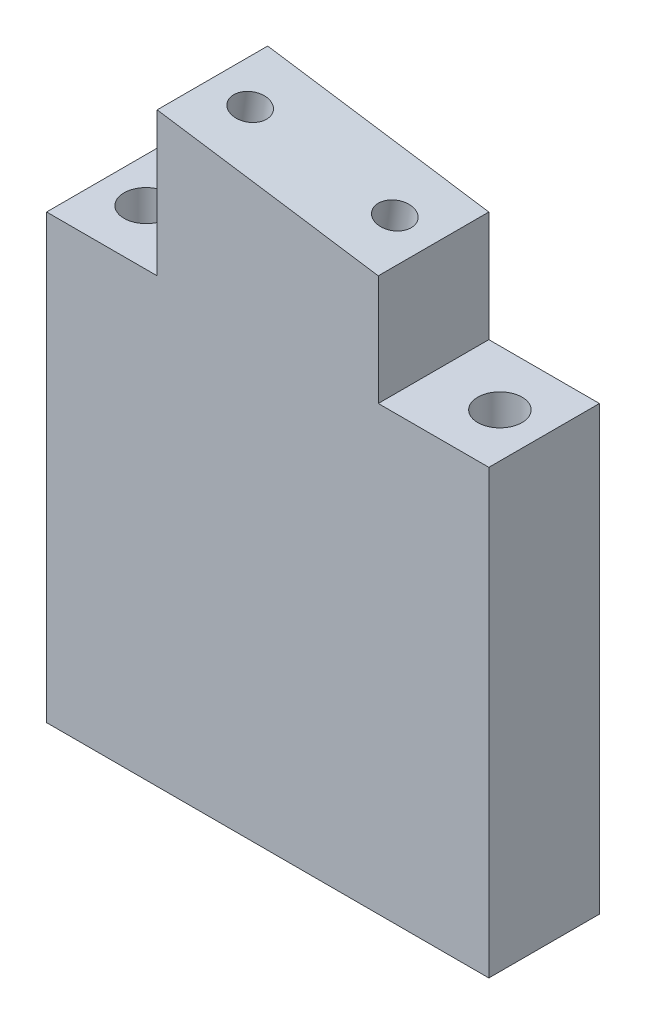
ISO-10303-21;
HEADER;
FILE_DESCRIPTION(('STEP AP214'),'2;1');
FILE_NAME('part.step','',(''),(''),'','','');
FILE_SCHEMA(('AUTOMOTIVE_DESIGN { 1 0 10303 214 1 1 1 1 }'));
ENDSEC;
DATA;
#1=APPLICATION_CONTEXT('core data for automotive mechanical design processes');
#2=APPLICATION_PROTOCOL_DEFINITION('international standard','automotive_design',2000,#1);
#3=PRODUCT_CONTEXT('',#1,'mechanical');
#4=PRODUCT('Part','Part','',(#3));
#5=PRODUCT_RELATED_PRODUCT_CATEGORY('part','',(#4));
#6=PRODUCT_DEFINITION_FORMATION('','',#4);
#7=PRODUCT_DEFINITION_CONTEXT('part definition',#1,'design');
#8=PRODUCT_DEFINITION('design','',#6,#7);
#9=PRODUCT_DEFINITION_SHAPE('','',#8);
#10=(LENGTH_UNIT() NAMED_UNIT(*) SI_UNIT(.MILLI.,.METRE.));
#11=(NAMED_UNIT(*) PLANE_ANGLE_UNIT() SI_UNIT($,.RADIAN.));
#12=(NAMED_UNIT(*) SI_UNIT($,.STERADIAN.) SOLID_ANGLE_UNIT());
#13=UNCERTAINTY_MEASURE_WITH_UNIT(LENGTH_MEASURE(1.E-05),#10,'distance_accuracy_value','');
#14=(GEOMETRIC_REPRESENTATION_CONTEXT(3) GLOBAL_UNCERTAINTY_ASSIGNED_CONTEXT((#13)) GLOBAL_UNIT_ASSIGNED_CONTEXT((#10,
#11,#12)) REPRESENTATION_CONTEXT('',''));
#15=CARTESIAN_POINT('',(0.,0.,0.));
#16=DIRECTION('',(0.,0.,1.));
#17=DIRECTION('',(1.,0.,0.));
#18=AXIS2_PLACEMENT_3D('',#15,#16,#17);
#19=CARTESIAN_POINT('',(-13.3476744186047,16.3953488372093,10.));
#20=DIRECTION('',(1.,0.,0.));
#21=DIRECTION('',(0.,1.,0.));
#22=AXIS2_PLACEMENT_3D('',#19,#20,#21);
#23=PLANE('',#22);
#24=DIRECTION('',(0.,-1.,0.));
#25=VECTOR('',#24,1.);
#26=CARTESIAN_POINT('',(-13.3476744186047,16.3953488372093,0.));
#27=LINE('',#26,#25);
#28=CARTESIAN_POINT('',(-13.3476744186047,16.3953488372093,0.));
#29=VERTEX_POINT('',#28);
#30=CARTESIAN_POINT('',(-13.3476744186047,-23.6046511627907,0.));
#31=VERTEX_POINT('',#30);
#32=EDGE_CURVE('E128',#29,#31,#27,.T.);
#33=ORIENTED_EDGE('',*,*,#32,.T.);
#34=DIRECTION('',(0.,0.,-1.));
#35=VECTOR('',#34,1.);
#36=CARTESIAN_POINT('',(-13.3476744186047,-23.6046511627907,10.));
#37=LINE('',#36,#35);
#38=CARTESIAN_POINT('',(-13.3476744186047,-23.6046511627907,10.));
#39=VERTEX_POINT('',#38);
#40=EDGE_CURVE('E11',#39,#31,#37,.T.);
#41=ORIENTED_EDGE('',*,*,#40,.F.);
#42=DIRECTION('',(0.,-1.,0.));
#43=VECTOR('',#42,1.);
#44=CARTESIAN_POINT('',(-13.3476744186047,16.3953488372093,10.));
#45=LINE('',#44,#43);
#46=CARTESIAN_POINT('',(-13.3476744186047,16.3953488372093,10.));
#47=VERTEX_POINT('',#46);
#48=EDGE_CURVE('E143',#47,#39,#45,.T.);
#49=ORIENTED_EDGE('',*,*,#48,.F.);
#50=DIRECTION('',(0.,0.,-1.));
#51=VECTOR('',#50,1.);
#52=CARTESIAN_POINT('',(-13.3476744186047,16.3953488372093,10.));
#53=LINE('',#52,#51);
#54=EDGE_CURVE('E124',#47,#29,#53,.T.);
#55=ORIENTED_EDGE('',*,*,#54,.T.);
#56=EDGE_LOOP('',(#33,#41,#49,#55));
#57=FACE_BOUND('',#56,.T.);
#58=ADVANCED_FACE('F32',(#57),#23,.F.);
#59=CARTESIAN_POINT('',(-13.3476744186047,-23.6046511627907,10.));
#60=DIRECTION('',(0.,1.,0.));
#61=DIRECTION('',(0.,0.,1.));
#62=AXIS2_PLACEMENT_3D('',#59,#60,#61);
#63=PLANE('',#62);
#64=CARTESIAN_POINT('',(-9.34767441860467,-23.6046511627907,5.));
#65=DIRECTION('',(0.,1.,0.));
#66=DIRECTION('',(0.,0.,1.));
#67=AXIS2_PLACEMENT_3D('',#64,#65,#66);
#68=CIRCLE('',#67,2.);
#69=CARTESIAN_POINT('',(-9.34767441860467,-23.6046511627907,7.));
#70=VERTEX_POINT('',#69);
#71=EDGE_CURVE('E193',#70,#70,#68,.T.);
#72=ORIENTED_EDGE('',*,*,#71,.T.);
#73=EDGE_LOOP('',(#72));
#74=FACE_BOUND('',#73,.T.);
#75=CARTESIAN_POINT('',(22.6523255813953,-23.6046511627907,5.));
#76=DIRECTION('',(0.,1.,0.));
#77=DIRECTION('',(0.,0.,1.));
#78=AXIS2_PLACEMENT_3D('',#75,#76,#77);
#79=CIRCLE('',#78,2.);
#80=CARTESIAN_POINT('',(22.6523255813953,-23.6046511627907,7.));
#81=VERTEX_POINT('',#80);
#82=EDGE_CURVE('E185',#81,#81,#79,.T.);
#83=ORIENTED_EDGE('',*,*,#82,.T.);
#84=EDGE_LOOP('',(#83));
#85=FACE_BOUND('',#84,.T.);
#86=DIRECTION('',(1.,0.,0.));
#87=VECTOR('',#86,1.);
#88=CARTESIAN_POINT('',(-13.3476744186047,-23.6046511627907,0.));
#89=LINE('',#88,#87);
#90=CARTESIAN_POINT('',(26.6523255813953,-23.6046511627907,0.));
#91=VERTEX_POINT('',#90);
#92=EDGE_CURVE('E131',#31,#91,#89,.T.);
#93=ORIENTED_EDGE('',*,*,#92,.T.);
#94=DIRECTION('',(0.,0.,-1.));
#95=VECTOR('',#94,1.);
#96=CARTESIAN_POINT('',(26.6523255813953,-23.6046511627907,10.));
#97=LINE('',#96,#95);
#98=CARTESIAN_POINT('',(26.6523255813953,-23.6046511627907,10.));
#99=VERTEX_POINT('',#98);
#100=EDGE_CURVE('E40',#99,#91,#97,.T.);
#101=ORIENTED_EDGE('',*,*,#100,.F.);
#102=DIRECTION('',(1.,0.,0.));
#103=VECTOR('',#102,1.);
#104=CARTESIAN_POINT('',(-13.3476744186047,-23.6046511627907,10.));
#105=LINE('',#104,#103);
#106=EDGE_CURVE('E90',#39,#99,#105,.T.);
#107=ORIENTED_EDGE('',*,*,#106,.F.);
#108=ORIENTED_EDGE('',*,*,#40,.T.);
#109=EDGE_LOOP('',(#93,#101,#107,#108));
#110=FACE_BOUND('',#109,.T.);
#111=ADVANCED_FACE('F214',(#74,#85,#110),#63,.F.);
#112=CARTESIAN_POINT('',(26.6523255813953,16.3953488372093,10.));
#113=DIRECTION('',(-1.,0.,0.));
#114=DIRECTION('',(0.,-1.,0.));
#115=AXIS2_PLACEMENT_3D('',#112,#113,#114);
#116=PLANE('',#115);
#117=DIRECTION('',(0.,1.,0.));
#118=VECTOR('',#117,1.);
#119=CARTESIAN_POINT('',(26.6523255813953,16.3953488372093,0.));
#120=LINE('',#119,#118);
#121=CARTESIAN_POINT('',(26.6523255813953,16.3953488372093,0.));
#122=VERTEX_POINT('',#121);
#123=EDGE_CURVE('E134',#91,#122,#120,.T.);
#124=ORIENTED_EDGE('',*,*,#123,.T.);
#125=DIRECTION('',(0.,0.,-1.));
#126=VECTOR('',#125,1.);
#127=CARTESIAN_POINT('',(26.6523255813953,16.3953488372093,10.));
#128=LINE('',#127,#126);
#129=CARTESIAN_POINT('',(26.6523255813953,16.3953488372093,10.));
#130=VERTEX_POINT('',#129);
#131=EDGE_CURVE('E150',#130,#122,#128,.T.);
#132=ORIENTED_EDGE('',*,*,#131,.F.);
#133=DIRECTION('',(0.,1.,0.));
#134=VECTOR('',#133,1.);
#135=CARTESIAN_POINT('',(26.6523255813953,16.3953488372093,10.));
#136=LINE('',#135,#134);
#137=EDGE_CURVE('E158',#99,#130,#136,.T.);
#138=ORIENTED_EDGE('',*,*,#137,.F.);
#139=ORIENTED_EDGE('',*,*,#100,.T.);
#140=EDGE_LOOP('',(#124,#132,#138,#139));
#141=FACE_BOUND('',#140,.T.);
#142=ADVANCED_FACE('F156',(#141),#116,.F.);
#143=CARTESIAN_POINT('',(16.6523255813953,16.3953488372093,10.));
#144=DIRECTION('',(0.,-1.,0.));
#145=DIRECTION('',(1.,0.,0.));
#146=AXIS2_PLACEMENT_3D('',#143,#144,#145);
#147=PLANE('',#146);
#148=CARTESIAN_POINT('',(22.6523255813953,16.3953488372093,5.));
#149=DIRECTION('',(0.,1.,0.));
#150=DIRECTION('',(0.,0.,1.));
#151=AXIS2_PLACEMENT_3D('',#148,#149,#150);
#152=CIRCLE('',#151,2.);
#153=CARTESIAN_POINT('',(22.6523255813953,16.3953488372093,7.));
#154=VERTEX_POINT('',#153);
#155=EDGE_CURVE('E190',#154,#154,#152,.T.);
#156=ORIENTED_EDGE('',*,*,#155,.F.);
#157=EDGE_LOOP('',(#156));
#158=FACE_BOUND('',#157,.T.);
#159=DIRECTION('',(-1.,0.,0.));
#160=VECTOR('',#159,1.);
#161=CARTESIAN_POINT('',(16.6523255813953,16.3953488372093,0.));
#162=LINE('',#161,#160);
#163=CARTESIAN_POINT('',(16.6523255813953,16.3953488372093,0.));
#164=VERTEX_POINT('',#163);
#165=EDGE_CURVE('E136',#122,#164,#162,.T.);
#166=ORIENTED_EDGE('',*,*,#165,.T.);
#167=DIRECTION('',(0.,0.,-1.));
#168=VECTOR('',#167,1.);
#169=CARTESIAN_POINT('',(16.6523255813953,16.3953488372093,10.));
#170=LINE('',#169,#168);
#171=CARTESIAN_POINT('',(16.6523255813953,16.3953488372093,10.));
#172=VERTEX_POINT('',#171);
#173=EDGE_CURVE('E147',#172,#164,#170,.T.);
#174=ORIENTED_EDGE('',*,*,#173,.F.);
#175=DIRECTION('',(-1.,0.,0.));
#176=VECTOR('',#175,1.);
#177=CARTESIAN_POINT('',(16.6523255813953,16.3953488372093,10.));
#178=LINE('',#177,#176);
#179=EDGE_CURVE('E170',#130,#172,#178,.T.);
#180=ORIENTED_EDGE('',*,*,#179,.F.);
#181=ORIENTED_EDGE('',*,*,#131,.T.);
#182=EDGE_LOOP('',(#166,#174,#180,#181));
#183=FACE_BOUND('',#182,.T.);
#184=ADVANCED_FACE('F166',(#158,#183),#147,.F.);
#185=CARTESIAN_POINT('',(16.6523255813953,16.3953488372093,10.));
#186=DIRECTION('',(-1.,0.,0.));
#187=DIRECTION('',(0.,0.,1.));
#188=AXIS2_PLACEMENT_3D('',#185,#186,#187);
#189=PLANE('',#188);
#190=DIRECTION('',(0.,1.,0.));
#191=VECTOR('',#190,1.);
#192=CARTESIAN_POINT('',(16.6523255813953,16.3953488372093,0.));
#193=LINE('',#192,#191);
#194=CARTESIAN_POINT('',(16.6523255813953,26.3953488372093,0.));
#195=VERTEX_POINT('',#194);
#196=EDGE_CURVE('E138',#164,#195,#193,.T.);
#197=ORIENTED_EDGE('',*,*,#196,.T.);
#198=DIRECTION('',(0.,0.,-1.));
#199=VECTOR('',#198,1.);
#200=CARTESIAN_POINT('',(16.6523255813953,26.3953488372093,10.));
#201=LINE('',#200,#199);
#202=CARTESIAN_POINT('',(16.6523255813953,26.3953488372093,10.));
#203=VERTEX_POINT('',#202);
#204=EDGE_CURVE('E119',#203,#195,#201,.T.);
#205=ORIENTED_EDGE('',*,*,#204,.F.);
#206=DIRECTION('',(0.,1.,0.));
#207=VECTOR('',#206,1.);
#208=CARTESIAN_POINT('',(16.6523255813953,16.3953488372093,10.));
#209=LINE('',#208,#207);
#210=EDGE_CURVE('E109',#172,#203,#209,.T.);
#211=ORIENTED_EDGE('',*,*,#210,.F.);
#212=ORIENTED_EDGE('',*,*,#173,.T.);
#213=EDGE_LOOP('',(#197,#205,#211,#212));
#214=FACE_BOUND('',#213,.T.);
#215=ADVANCED_FACE('F169',(#214),#189,.F.);
#216=CARTESIAN_POINT('',(-3.34767441860466,29.3953488372093,10.));
#217=DIRECTION('',(-0.148340452930245,-0.988936352868298,0.));
#218=DIRECTION('',(0.988936352868298,-0.148340452930245,0.));
#219=AXIS2_PLACEMENT_3D('',#216,#217,#218);
#220=PLANE('',#219);
#221=CARTESIAN_POINT('',(13.1910483463563,26.9145404224652,5.04720053231722));
#222=DIRECTION('',(0.148340452930245,0.988936352868298,0.));
#223=DIRECTION('',(-0.988936352868298,0.148340452930245,0.));
#224=AXIS2_PLACEMENT_3D('',#221,#222,#223);
#225=CIRCLE('',#224,1.5);
#226=CARTESIAN_POINT('',(11.7076438170538,27.1370511018605,5.04720053231722));
#227=VERTEX_POINT('',#226);
#228=EDGE_CURVE('E182',#227,#227,#225,.T.);
#229=ORIENTED_EDGE('',*,*,#228,.F.);
#230=EDGE_LOOP('',(#229));
#231=FACE_BOUND('',#230,.T.);
#232=CARTESIAN_POINT('',(0.113602816434375,28.8761572519534,5.04720053231722));
#233=DIRECTION('',(0.148340452930245,0.988936352868298,0.));
#234=DIRECTION('',(-0.988936352868298,0.148340452930245,0.));
#235=AXIS2_PLACEMENT_3D('',#232,#233,#234);
#236=CIRCLE('',#235,1.5);
#237=CARTESIAN_POINT('',(-1.36980171286807,29.0986679313488,5.04720053231722));
#238=VERTEX_POINT('',#237);
#239=EDGE_CURVE('E176',#238,#238,#236,.T.);
#240=ORIENTED_EDGE('',*,*,#239,.F.);
#241=EDGE_LOOP('',(#240));
#242=FACE_BOUND('',#241,.T.);
#243=DIRECTION('',(-0.988936352868298,0.148340452930245,0.));
#244=VECTOR('',#243,1.);
#245=CARTESIAN_POINT('',(-3.34767441860466,29.3953488372093,0.));
#246=LINE('',#245,#244);
#247=CARTESIAN_POINT('',(-3.34767441860466,29.3953488372093,0.));
#248=VERTEX_POINT('',#247);
#249=EDGE_CURVE('E118',#195,#248,#246,.T.);
#250=ORIENTED_EDGE('',*,*,#249,.T.);
#251=DIRECTION('',(0.,0.,-1.));
#252=VECTOR('',#251,1.);
#253=CARTESIAN_POINT('',(-3.34767441860466,29.3953488372093,10.));
#254=LINE('',#253,#252);
#255=CARTESIAN_POINT('',(-3.34767441860466,29.3953488372093,10.));
#256=VERTEX_POINT('',#255);
#257=EDGE_CURVE('E115',#256,#248,#254,.T.);
#258=ORIENTED_EDGE('',*,*,#257,.F.);
#259=DIRECTION('',(-0.988936352868298,0.148340452930245,0.));
#260=VECTOR('',#259,1.);
#261=CARTESIAN_POINT('',(-3.34767441860466,29.3953488372093,10.));
#262=LINE('',#261,#260);
#263=EDGE_CURVE('E103',#203,#256,#262,.T.);
#264=ORIENTED_EDGE('',*,*,#263,.F.);
#265=ORIENTED_EDGE('',*,*,#204,.T.);
#266=EDGE_LOOP('',(#250,#258,#264,#265));
#267=FACE_BOUND('',#266,.T.);
#268=ADVANCED_FACE('F116',(#231,#242,#267),#220,.F.);
#269=CARTESIAN_POINT('',(-3.34767441860466,16.3953488372093,10.));
#270=DIRECTION('',(1.,0.,0.));
#271=DIRECTION('',(0.,0.,-1.));
#272=AXIS2_PLACEMENT_3D('',#269,#270,#271);
#273=PLANE('',#272);
#274=DIRECTION('',(0.,-1.,0.));
#275=VECTOR('',#274,1.);
#276=CARTESIAN_POINT('',(-3.34767441860466,16.3953488372093,0.));
#277=LINE('',#276,#275);
#278=CARTESIAN_POINT('',(-3.34767441860466,16.3953488372093,0.));
#279=VERTEX_POINT('',#278);
#280=EDGE_CURVE('E76',#248,#279,#277,.T.);
#281=ORIENTED_EDGE('',*,*,#280,.T.);
#282=DIRECTION('',(0.,0.,-1.));
#283=VECTOR('',#282,1.);
#284=CARTESIAN_POINT('',(-3.34767441860466,16.3953488372093,10.));
#285=LINE('',#284,#283);
#286=CARTESIAN_POINT('',(-3.34767441860466,16.3953488372093,10.));
#287=VERTEX_POINT('',#286);
#288=EDGE_CURVE('E120',#287,#279,#285,.T.);
#289=ORIENTED_EDGE('',*,*,#288,.F.);
#290=DIRECTION('',(0.,-1.,0.));
#291=VECTOR('',#290,1.);
#292=CARTESIAN_POINT('',(-3.34767441860466,26.3953488372093,10.));
#293=LINE('',#292,#291);
#294=EDGE_CURVE('E107',#256,#287,#293,.T.);
#295=ORIENTED_EDGE('',*,*,#294,.F.);
#296=ORIENTED_EDGE('',*,*,#257,.T.);
#297=EDGE_LOOP('',(#281,#289,#295,#296));
#298=FACE_BOUND('',#297,.T.);
#299=ADVANCED_FACE('F122',(#298),#273,.F.);
#300=CARTESIAN_POINT('',(-13.3476744186047,16.3953488372093,10.));
#301=DIRECTION('',(0.,-1.,0.));
#302=DIRECTION('',(1.,0.,0.));
#303=AXIS2_PLACEMENT_3D('',#300,#301,#302);
#304=PLANE('',#303);
#305=CARTESIAN_POINT('',(-9.34767441860467,16.3953488372093,5.));
#306=DIRECTION('',(0.,1.,0.));
#307=DIRECTION('',(0.,0.,1.));
#308=AXIS2_PLACEMENT_3D('',#305,#306,#307);
#309=CIRCLE('',#308,2.);
#310=CARTESIAN_POINT('',(-9.34767441860467,16.3953488372093,7.));
#311=VERTEX_POINT('',#310);
#312=EDGE_CURVE('E196',#311,#311,#309,.T.);
#313=ORIENTED_EDGE('',*,*,#312,.F.);
#314=EDGE_LOOP('',(#313));
#315=FACE_BOUND('',#314,.T.);
#316=DIRECTION('',(-1.,0.,0.));
#317=VECTOR('',#316,1.);
#318=CARTESIAN_POINT('',(-13.3476744186047,16.3953488372093,0.));
#319=LINE('',#318,#317);
#320=EDGE_CURVE('E82',#279,#29,#319,.T.);
#321=ORIENTED_EDGE('',*,*,#320,.T.);
#322=ORIENTED_EDGE('',*,*,#54,.F.);
#323=DIRECTION('',(-1.,0.,0.));
#324=VECTOR('',#323,1.);
#325=CARTESIAN_POINT('',(-13.3476744186047,16.3953488372093,10.));
#326=LINE('',#325,#324);
#327=EDGE_CURVE('E48',#287,#47,#326,.T.);
#328=ORIENTED_EDGE('',*,*,#327,.F.);
#329=ORIENTED_EDGE('',*,*,#288,.T.);
#330=EDGE_LOOP('',(#321,#322,#328,#329));
#331=FACE_BOUND('',#330,.T.);
#332=ADVANCED_FACE('F203',(#315,#331),#304,.F.);
#333=CARTESIAN_POINT('',(0.,0.,10.));
#334=DIRECTION('',(0.,0.,1.));
#335=DIRECTION('',(1.,0.,0.));
#336=AXIS2_PLACEMENT_3D('',#333,#334,#335);
#337=PLANE('',#336);
#338=ORIENTED_EDGE('',*,*,#48,.T.);
#339=ORIENTED_EDGE('',*,*,#106,.T.);
#340=ORIENTED_EDGE('',*,*,#137,.T.);
#341=ORIENTED_EDGE('',*,*,#179,.T.);
#342=ORIENTED_EDGE('',*,*,#210,.T.);
#343=ORIENTED_EDGE('',*,*,#263,.T.);
#344=ORIENTED_EDGE('',*,*,#294,.T.);
#345=ORIENTED_EDGE('',*,*,#327,.T.);
#346=EDGE_LOOP('',(#338,#339,#340,#341,#342,#343,#344,#345));
#347=FACE_BOUND('',#346,.T.);
#348=ADVANCED_FACE('F105',(#347),#337,.T.);
#349=CARTESIAN_POINT('',(0.,0.,0.));
#350=DIRECTION('',(0.,0.,1.));
#351=DIRECTION('',(1.,0.,0.));
#352=AXIS2_PLACEMENT_3D('',#349,#350,#351);
#353=PLANE('',#352);
#354=ORIENTED_EDGE('',*,*,#32,.F.);
#355=ORIENTED_EDGE('',*,*,#320,.F.);
#356=ORIENTED_EDGE('',*,*,#280,.F.);
#357=ORIENTED_EDGE('',*,*,#249,.F.);
#358=ORIENTED_EDGE('',*,*,#196,.F.);
#359=ORIENTED_EDGE('',*,*,#165,.F.);
#360=ORIENTED_EDGE('',*,*,#123,.F.);
#361=ORIENTED_EDGE('',*,*,#92,.F.);
#362=EDGE_LOOP('',(#354,#355,#356,#357,#358,#359,#360,#361));
#363=FACE_BOUND('',#362,.T.);
#364=ADVANCED_FACE('F162',(#363),#353,.F.);
#365=CARTESIAN_POINT('',(-1.36980171286807,18.9867937232705,5.04720053231722));
#366=DIRECTION('',(0.148340452930245,0.988936352868298,0.));
#367=DIRECTION('',(-0.988936352868298,0.148340452930245,0.));
#368=AXIS2_PLACEMENT_3D('',#365,#366,#367);
#369=CYLINDRICAL_SURFACE('',#368,1.5);
#370=CARTESIAN_POINT('',(-1.36980171286807,18.9867937232705,5.04720053231722));
#371=DIRECTION('',(0.148340452930245,0.988936352868298,0.));
#372=DIRECTION('',(-0.988936352868298,0.148340452930245,0.));
#373=AXIS2_PLACEMENT_3D('',#370,#371,#372);
#374=CIRCLE('',#373,1.5);
#375=CARTESIAN_POINT('',(-2.85320624217052,19.2093044026658,5.04720053231722));
#376=VERTEX_POINT('',#375);
#377=EDGE_CURVE('E132',#376,#376,#374,.T.);
#378=ORIENTED_EDGE('',*,*,#377,.F.);
#379=EDGE_LOOP('',(#378));
#380=FACE_BOUND('',#379,.T.);
#381=ORIENTED_EDGE('',*,*,#239,.T.);
#382=EDGE_LOOP('',(#381));
#383=FACE_BOUND('',#382,.T.);
#384=ADVANCED_FACE('F241',(#380,#383),#369,.F.);
#385=CARTESIAN_POINT('',(-1.36980171286807,18.9867937232705,5.04720053231722));
#386=DIRECTION('',(0.148340452930245,0.988936352868298,0.));
#387=DIRECTION('',(-0.988936352868298,0.148340452930245,0.));
#388=AXIS2_PLACEMENT_3D('',#385,#386,#387);
#389=PLANE('',#388);
#390=ORIENTED_EDGE('',*,*,#377,.T.);
#391=EDGE_LOOP('',(#390));
#392=FACE_BOUND('',#391,.T.);
#393=ADVANCED_FACE('F243',(#392),#389,.T.);
#394=CARTESIAN_POINT('',(11.7076438170538,17.0251768937822,5.04720053231722));
#395=DIRECTION('',(0.148340452930245,0.988936352868298,0.));
#396=DIRECTION('',(-0.988936352868298,0.148340452930245,0.));
#397=AXIS2_PLACEMENT_3D('',#394,#395,#396);
#398=CYLINDRICAL_SURFACE('',#397,1.5);
#399=CARTESIAN_POINT('',(11.7076438170538,17.0251768937822,5.04720053231722));
#400=DIRECTION('',(0.148340452930245,0.988936352868298,0.));
#401=DIRECTION('',(-0.988936352868298,0.148340452930245,0.));
#402=AXIS2_PLACEMENT_3D('',#399,#400,#401);
#403=CIRCLE('',#402,1.5);
#404=CARTESIAN_POINT('',(10.2242392877514,17.2476875731775,5.04720053231722));
#405=VERTEX_POINT('',#404);
#406=EDGE_CURVE('E179',#405,#405,#403,.T.);
#407=ORIENTED_EDGE('',*,*,#406,.F.);
#408=EDGE_LOOP('',(#407));
#409=FACE_BOUND('',#408,.T.);
#410=ORIENTED_EDGE('',*,*,#228,.T.);
#411=EDGE_LOOP('',(#410));
#412=FACE_BOUND('',#411,.T.);
#413=ADVANCED_FACE('F250',(#409,#412),#398,.F.);
#414=CARTESIAN_POINT('',(11.7076438170538,17.0251768937822,5.04720053231722));
#415=DIRECTION('',(0.148340452930245,0.988936352868298,0.));
#416=DIRECTION('',(-0.988936352868298,0.148340452930245,0.));
#417=AXIS2_PLACEMENT_3D('',#414,#415,#416);
#418=PLANE('',#417);
#419=ORIENTED_EDGE('',*,*,#406,.T.);
#420=EDGE_LOOP('',(#419));
#421=FACE_BOUND('',#420,.T.);
#422=ADVANCED_FACE('F257',(#421),#418,.T.);
#423=CARTESIAN_POINT('',(22.6523255813953,-33.6046511627907,5.));
#424=DIRECTION('',(0.,1.,0.));
#425=DIRECTION('',(0.,0.,1.));
#426=AXIS2_PLACEMENT_3D('',#423,#424,#425);
#427=CYLINDRICAL_SURFACE('',#426,2.);
#428=ORIENTED_EDGE('',*,*,#155,.T.);
#429=EDGE_LOOP('',(#428));
#430=FACE_BOUND('',#429,.T.);
#431=ORIENTED_EDGE('',*,*,#82,.F.);
#432=EDGE_LOOP('',(#431));
#433=FACE_BOUND('',#432,.T.);
#434=ADVANCED_FACE('F261',(#430,#433),#427,.F.);
#435=CARTESIAN_POINT('',(-9.34767441860467,-33.6046511627907,5.));
#436=DIRECTION('',(0.,1.,0.));
#437=DIRECTION('',(0.,0.,1.));
#438=AXIS2_PLACEMENT_3D('',#435,#436,#437);
#439=CYLINDRICAL_SURFACE('',#438,2.);
#440=ORIENTED_EDGE('',*,*,#312,.T.);
#441=EDGE_LOOP('',(#440));
#442=FACE_BOUND('',#441,.T.);
#443=ORIENTED_EDGE('',*,*,#71,.F.);
#444=EDGE_LOOP('',(#443));
#445=FACE_BOUND('',#444,.T.);
#446=ADVANCED_FACE('F200',(#442,#445),#439,.F.);
#447=CLOSED_SHELL('',(#58,#111,#142,#184,#215,#268,#299,#332,#348,#364,#384,#393,#413,#422,#434,#446));
#448=MANIFOLD_SOLID_BREP('B2',#447);
#449=ADVANCED_BREP_SHAPE_REPRESENTATION('',(#18,#448),#14);
#450=SHAPE_DEFINITION_REPRESENTATION(#9,#449);
ENDSEC;
END-ISO-10303-21;
